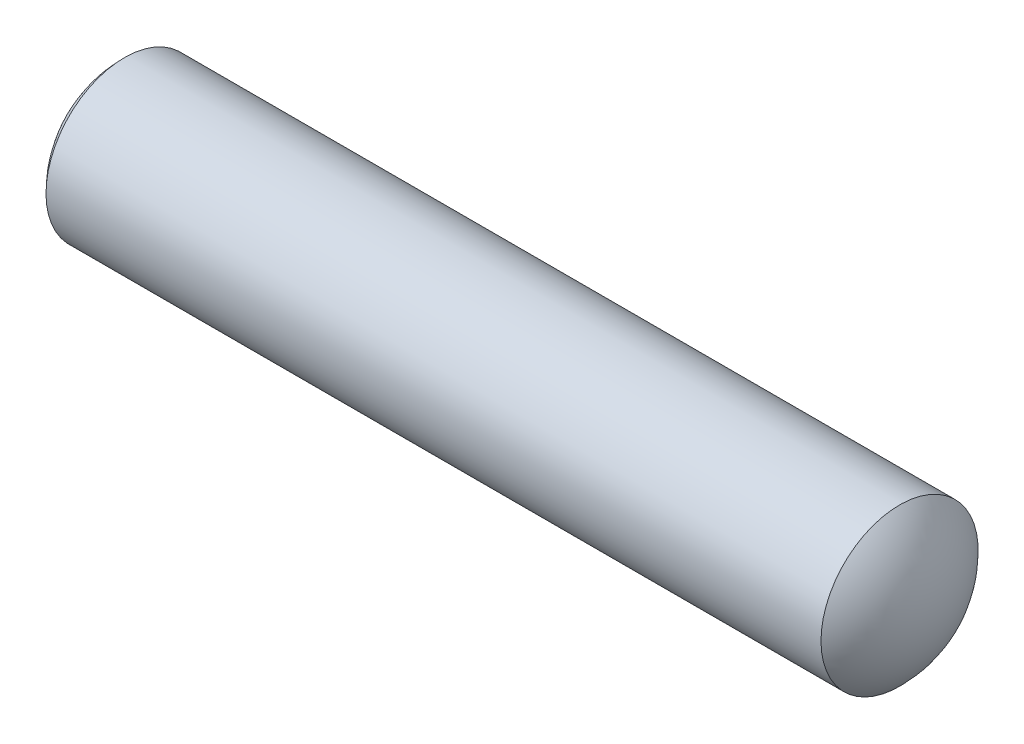
ISO-10303-21;
HEADER;
FILE_DESCRIPTION(('STEP AP214'),'2;1');
FILE_NAME('part.step','',(''),(''),'','','');
FILE_SCHEMA(('AUTOMOTIVE_DESIGN { 1 0 10303 214 1 1 1 1 }'));
ENDSEC;
DATA;
#1=APPLICATION_CONTEXT('core data for automotive mechanical design processes');
#2=APPLICATION_PROTOCOL_DEFINITION('international standard','automotive_design',2000,#1);
#3=PRODUCT_CONTEXT('',#1,'mechanical');
#4=PRODUCT('Part','Part','',(#3));
#5=PRODUCT_RELATED_PRODUCT_CATEGORY('part','',(#4));
#6=PRODUCT_DEFINITION_FORMATION('','',#4);
#7=PRODUCT_DEFINITION_CONTEXT('part definition',#1,'design');
#8=PRODUCT_DEFINITION('design','',#6,#7);
#9=PRODUCT_DEFINITION_SHAPE('','',#8);
#10=(LENGTH_UNIT() NAMED_UNIT(*) SI_UNIT(.MILLI.,.METRE.));
#11=(NAMED_UNIT(*) PLANE_ANGLE_UNIT() SI_UNIT($,.RADIAN.));
#12=(NAMED_UNIT(*) SI_UNIT($,.STERADIAN.) SOLID_ANGLE_UNIT());
#13=UNCERTAINTY_MEASURE_WITH_UNIT(LENGTH_MEASURE(1.E-05),#10,'distance_accuracy_value','');
#14=(GEOMETRIC_REPRESENTATION_CONTEXT(3) GLOBAL_UNCERTAINTY_ASSIGNED_CONTEXT((#13)) GLOBAL_UNIT_ASSIGNED_CONTEXT((#10,
#11,#12)) REPRESENTATION_CONTEXT('',''));
#15=CARTESIAN_POINT('',(0.,0.,0.));
#16=DIRECTION('',(0.,0.,1.));
#17=DIRECTION('',(1.,0.,0.));
#18=AXIS2_PLACEMENT_3D('',#15,#16,#17);
#19=CARTESIAN_POINT('',(15.1875,20.449194000159,6.00442511768297));
#20=DIRECTION('',(0.,-0.281732556841429,0.959492973614498));
#21=DIRECTION('',(1.,0.,0.));
#22=AXIS2_PLACEMENT_3D('',#19,#20,#21);
#23=SPHERICAL_SURFACE('',#22,1.8375);
#24=CARTESIAN_POINT('',(15.1875,20.449194000159,6.00442511768297));
#25=DIRECTION('',(-1.,0.,0.));
#26=DIRECTION('',(0.,-0.959492973614497,-0.28173255684143));
#27=AXIS2_PLACEMENT_3D('',#24,#25,#26);
#28=SPHERICAL_SURFACE('',#27,1.8375);
#29=CARTESIAN_POINT('',(16.4734821149612,20.449194000159,6.00442511768297));
#30=DIRECTION('',(-1.,0.,0.));
#31=DIRECTION('',(0.,-0.959492973614497,-0.28173255684143));
#32=AXIS2_PLACEMENT_3D('',#29,#30,#31);
#33=CIRCLE('',#32,1.3125);
#34=CARTESIAN_POINT('',(16.4734821149612,19.18985947229,5.63465113682859));
#35=VERTEX_POINT('',#34);
#36=EDGE_CURVE('E11',#35,#35,#33,.T.);
#37=ORIENTED_EDGE('',*,*,#36,.F.);
#38=EDGE_LOOP('',(#37));
#39=FACE_BOUND('',#38,.T.);
#40=ADVANCED_FACE('F17',(#39),#28,.T.);
#41=CARTESIAN_POINT('',(10.,20.449194000159,6.00442511768297));
#42=DIRECTION('',(-1.,0.,0.));
#43=DIRECTION('',(0.,-0.959492973614497,-0.28173255684143));
#44=AXIS2_PLACEMENT_3D('',#41,#42,#43);
#45=CYLINDRICAL_SURFACE('',#44,1.3125);
#46=CARTESIAN_POINT('',(3.52651788503884,20.449194000159,6.00442511768297));
#47=DIRECTION('',(-1.,0.,0.));
#48=DIRECTION('',(0.,-0.959492973614497,-0.28173255684143));
#49=AXIS2_PLACEMENT_3D('',#46,#47,#48);
#50=CIRCLE('',#49,1.3125);
#51=CARTESIAN_POINT('',(3.52651788503884,19.18985947229,5.63465113682859));
#52=VERTEX_POINT('',#51);
#53=EDGE_CURVE('E27',#52,#52,#50,.T.);
#54=ORIENTED_EDGE('',*,*,#53,.F.);
#55=EDGE_LOOP('',(#54));
#56=FACE_BOUND('',#55,.T.);
#57=ORIENTED_EDGE('',*,*,#36,.T.);
#58=EDGE_LOOP('',(#57));
#59=FACE_BOUND('',#58,.T.);
#60=ADVANCED_FACE('F19',(#56,#59),#45,.T.);
#61=CARTESIAN_POINT('',(4.8125,20.449194000159,6.00442511768297));
#62=DIRECTION('',(0.,-0.281732556841429,0.959492973614498));
#63=DIRECTION('',(-1.,0.,0.));
#64=AXIS2_PLACEMENT_3D('',#61,#62,#63);
#65=SPHERICAL_SURFACE('',#64,1.8375);
#66=CARTESIAN_POINT('',(4.8125,20.449194000159,6.00442511768297));
#67=DIRECTION('',(-1.,0.,0.));
#68=DIRECTION('',(0.,-0.959492973614497,-0.28173255684143));
#69=AXIS2_PLACEMENT_3D('',#66,#67,#68);
#70=SPHERICAL_SURFACE('',#69,1.8375);
#71=ORIENTED_EDGE('',*,*,#53,.T.);
#72=EDGE_LOOP('',(#71));
#73=FACE_BOUND('',#72,.T.);
#74=ADVANCED_FACE('F40',(#73),#70,.T.);
#75=CLOSED_SHELL('',(#40,#60,#74));
#76=MANIFOLD_SOLID_BREP('B1',#75);
#77=ADVANCED_BREP_SHAPE_REPRESENTATION('',(#18,#76),#14);
#78=SHAPE_DEFINITION_REPRESENTATION(#9,#77);
ENDSEC;
END-ISO-10303-21;
